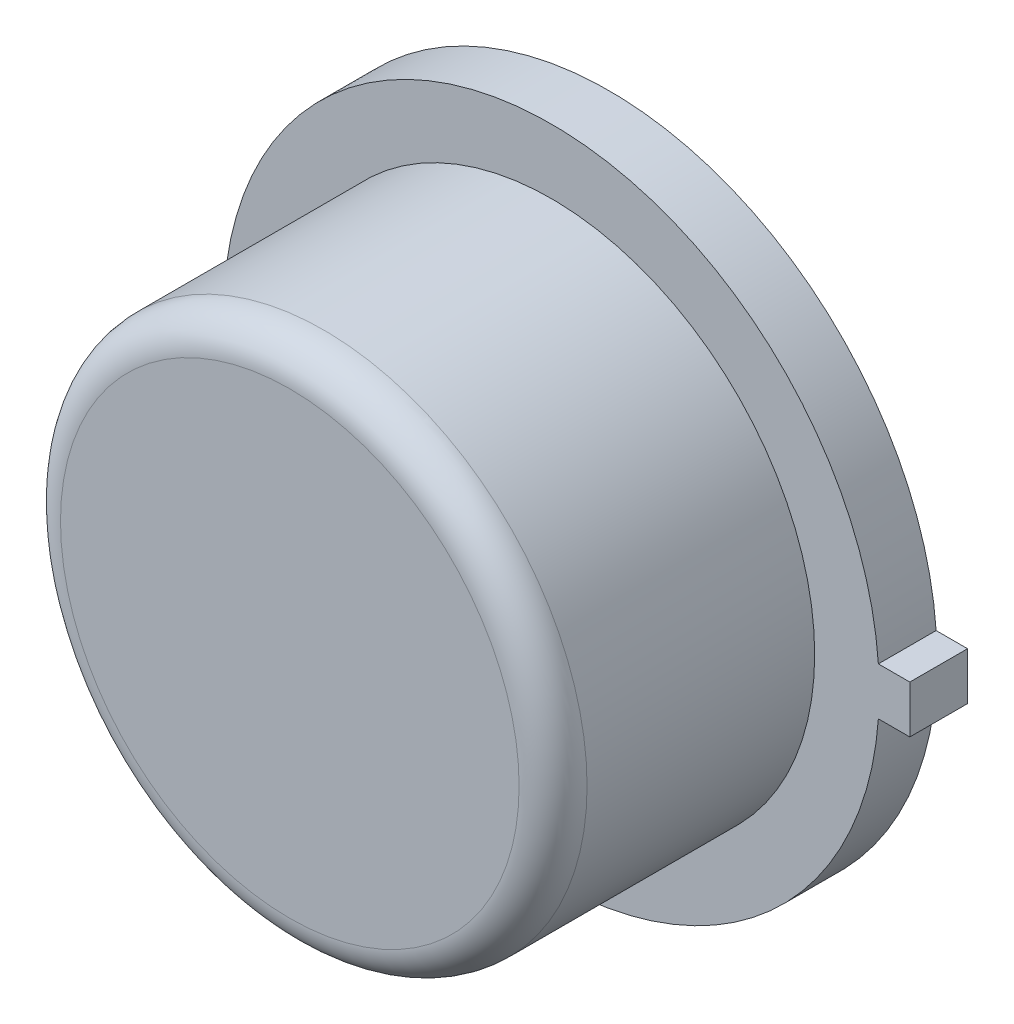
ISO-10303-21;
HEADER;
FILE_DESCRIPTION(('STEP AP214'),'2;1');
FILE_NAME('part.step','',(''),(''),'','','');
FILE_SCHEMA(('AUTOMOTIVE_DESIGN { 1 0 10303 214 1 1 1 1 }'));
ENDSEC;
DATA;
#1=APPLICATION_CONTEXT('core data for automotive mechanical design processes');
#2=APPLICATION_PROTOCOL_DEFINITION('international standard','automotive_design',2000,#1);
#3=PRODUCT_CONTEXT('',#1,'mechanical');
#4=PRODUCT('Part','Part','',(#3));
#5=PRODUCT_RELATED_PRODUCT_CATEGORY('part','',(#4));
#6=PRODUCT_DEFINITION_FORMATION('','',#4);
#7=PRODUCT_DEFINITION_CONTEXT('part definition',#1,'design');
#8=PRODUCT_DEFINITION('design','',#6,#7);
#9=PRODUCT_DEFINITION_SHAPE('','',#8);
#10=(LENGTH_UNIT() NAMED_UNIT(*) SI_UNIT(.MILLI.,.METRE.));
#11=(NAMED_UNIT(*) PLANE_ANGLE_UNIT() SI_UNIT($,.RADIAN.));
#12=(NAMED_UNIT(*) SI_UNIT($,.STERADIAN.) SOLID_ANGLE_UNIT());
#13=UNCERTAINTY_MEASURE_WITH_UNIT(LENGTH_MEASURE(1.E-05),#10,'distance_accuracy_value','');
#14=(GEOMETRIC_REPRESENTATION_CONTEXT(3) GLOBAL_UNCERTAINTY_ASSIGNED_CONTEXT((#13)) GLOBAL_UNIT_ASSIGNED_CONTEXT((#10,
#11,#12)) REPRESENTATION_CONTEXT('',''));
#15=CARTESIAN_POINT('',(0.,0.,0.));
#16=DIRECTION('',(0.,0.,1.));
#17=DIRECTION('',(1.,0.,0.));
#18=AXIS2_PLACEMENT_3D('',#15,#16,#17);
#19=CARTESIAN_POINT('',(-0.00322860507148085,-5.53029106093277,0.));
#20=DIRECTION('',(0.,0.,1.));
#21=DIRECTION('',(1.,0.,0.));
#22=AXIS2_PLACEMENT_3D('',#19,#20,#21);
#23=PLANE('',#22);
#24=DIRECTION('',(1.,0.,0.));
#25=VECTOR('',#24,1.);
#26=CARTESIAN_POINT('',(-0.0032286050714822,0.177799999999999,0.));
#27=LINE('',#26,#25);
#28=CARTESIAN_POINT('',(2.44464278985704,0.177799999999999,0.));
#29=VERTEX_POINT('',#28);
#30=CARTESIAN_POINT('',(2.6797,0.177799999999999,0.));
#31=VERTEX_POINT('',#30);
#32=EDGE_CURVE('E101',#29,#31,#27,.T.);
#33=ORIENTED_EDGE('',*,*,#32,.T.);
#34=DIRECTION('',(0.,-1.,0.));
#35=VECTOR('',#34,1.);
#36=CARTESIAN_POINT('',(2.6797,-5.53029106093277,0.));
#37=LINE('',#36,#35);
#38=CARTESIAN_POINT('',(2.6797,-0.1778,0.));
#39=VERTEX_POINT('',#38);
#40=EDGE_CURVE('E107',#31,#39,#37,.T.);
#41=ORIENTED_EDGE('',*,*,#40,.T.);
#42=DIRECTION('',(-1.,0.,0.));
#43=VECTOR('',#42,1.);
#44=CARTESIAN_POINT('',(-0.00322860507148085,-0.1778,0.));
#45=LINE('',#44,#43);
#46=CARTESIAN_POINT('',(2.44464278985704,-0.1778,0.));
#47=VERTEX_POINT('',#46);
#48=EDGE_CURVE('E105',#39,#47,#45,.T.);
#49=ORIENTED_EDGE('',*,*,#48,.T.);
#50=CARTESIAN_POINT('',(0.,0.,0.));
#51=DIRECTION('',(0.,0.,1.));
#52=DIRECTION('',(1.,0.,0.));
#53=AXIS2_PLACEMENT_3D('',#50,#51,#52);
#54=CIRCLE('',#53,2.4511);
#55=EDGE_CURVE('E91',#29,#47,#54,.T.);
#56=ORIENTED_EDGE('',*,*,#55,.F.);
#57=EDGE_LOOP('',(#33,#41,#49,#56));
#58=FACE_BOUND('',#57,.T.);
#59=CARTESIAN_POINT('',(0.,0.,0.));
#60=DIRECTION('',(0.,0.,1.));
#61=DIRECTION('',(1.,0.,0.));
#62=AXIS2_PLACEMENT_3D('',#59,#60,#61);
#63=CIRCLE('',#62,1.75756648099992);
#64=CARTESIAN_POINT('',(1.75756648099992,0.,0.));
#65=VERTEX_POINT('',#64);
#66=EDGE_CURVE('E113',#65,#65,#63,.F.);
#67=ORIENTED_EDGE('',*,*,#66,.F.);
#68=EDGE_LOOP('',(#67));
#69=FACE_BOUND('',#68,.T.);
#70=ADVANCED_FACE('F32',(#58,#69),#23,.F.);
#71=CARTESIAN_POINT('',(-0.00322860507148085,-5.53029106093277,0.4318));
#72=DIRECTION('',(0.,0.,1.));
#73=DIRECTION('',(1.,0.,0.));
#74=AXIS2_PLACEMENT_3D('',#71,#72,#73);
#75=PLANE('',#74);
#76=DIRECTION('',(1.,0.,0.));
#77=VECTOR('',#76,1.);
#78=CARTESIAN_POINT('',(-0.0032286050714822,0.177799999999999,0.4318));
#79=LINE('',#78,#77);
#80=CARTESIAN_POINT('',(2.44464278985704,0.177799999999999,0.4318));
#81=VERTEX_POINT('',#80);
#82=CARTESIAN_POINT('',(2.6797,0.177799999999999,0.4318));
#83=VERTEX_POINT('',#82);
#84=EDGE_CURVE('E84',#81,#83,#79,.T.);
#85=ORIENTED_EDGE('',*,*,#84,.F.);
#86=CARTESIAN_POINT('',(0.,0.,0.4318));
#87=DIRECTION('',(0.,0.,1.));
#88=DIRECTION('',(1.,0.,0.));
#89=AXIS2_PLACEMENT_3D('',#86,#87,#88);
#90=CIRCLE('',#89,2.4511);
#91=CARTESIAN_POINT('',(2.44464278985704,-0.1778,0.4318));
#92=VERTEX_POINT('',#91);
#93=EDGE_CURVE('E77',#81,#92,#90,.T.);
#94=ORIENTED_EDGE('',*,*,#93,.T.);
#95=DIRECTION('',(-1.,0.,0.));
#96=VECTOR('',#95,1.);
#97=CARTESIAN_POINT('',(-0.00322860507148085,-0.1778,0.4318));
#98=LINE('',#97,#96);
#99=CARTESIAN_POINT('',(2.6797,-0.1778,0.4318));
#100=VERTEX_POINT('',#99);
#101=EDGE_CURVE('E83',#100,#92,#98,.T.);
#102=ORIENTED_EDGE('',*,*,#101,.F.);
#103=DIRECTION('',(0.,-1.,0.));
#104=VECTOR('',#103,1.);
#105=CARTESIAN_POINT('',(2.6797,-5.53029106093277,0.4318));
#106=LINE('',#105,#104);
#107=EDGE_CURVE('E96',#83,#100,#106,.T.);
#108=ORIENTED_EDGE('',*,*,#107,.F.);
#109=EDGE_LOOP('',(#85,#94,#102,#108));
#110=FACE_BOUND('',#109,.T.);
#111=CARTESIAN_POINT('',(0.,0.,0.4318));
#112=DIRECTION('',(0.,0.,1.));
#113=DIRECTION('',(1.,0.,0.));
#114=AXIS2_PLACEMENT_3D('',#111,#112,#113);
#115=CIRCLE('',#114,1.9685);
#116=CARTESIAN_POINT('',(1.9685,0.,0.4318));
#117=VERTEX_POINT('',#116);
#118=EDGE_CURVE('E103',#117,#117,#115,.T.);
#119=ORIENTED_EDGE('',*,*,#118,.F.);
#120=EDGE_LOOP('',(#119));
#121=FACE_BOUND('',#120,.T.);
#122=ADVANCED_FACE('F79',(#110,#121),#75,.T.);
#123=CARTESIAN_POINT('',(-0.0032286050714822,0.177799999999999,0.4318));
#124=DIRECTION('',(0.,1.,0.));
#125=DIRECTION('',(-1.,0.,0.));
#126=AXIS2_PLACEMENT_3D('',#123,#124,#125);
#127=PLANE('',#126);
#128=ORIENTED_EDGE('',*,*,#32,.F.);
#129=DIRECTION('',(0.,0.,-1.));
#130=VECTOR('',#129,1.);
#131=CARTESIAN_POINT('',(2.44464278985704,0.177799999999999,0.4318));
#132=LINE('',#131,#130);
#133=EDGE_CURVE('E71',#81,#29,#132,.T.);
#134=ORIENTED_EDGE('',*,*,#133,.F.);
#135=ORIENTED_EDGE('',*,*,#84,.T.);
#136=DIRECTION('',(0.,0.,-1.));
#137=VECTOR('',#136,1.);
#138=CARTESIAN_POINT('',(2.6797,0.177799999999999,0.4318));
#139=LINE('',#138,#137);
#140=EDGE_CURVE('E49',#83,#31,#139,.T.);
#141=ORIENTED_EDGE('',*,*,#140,.T.);
#142=EDGE_LOOP('',(#128,#134,#135,#141));
#143=FACE_BOUND('',#142,.T.);
#144=ADVANCED_FACE('F136',(#143),#127,.T.);
#145=CARTESIAN_POINT('',(0.,0.,0.4318));
#146=DIRECTION('',(0.,0.,-1.));
#147=DIRECTION('',(-1.,0.,0.));
#148=AXIS2_PLACEMENT_3D('',#145,#146,#147);
#149=CYLINDRICAL_SURFACE('',#148,2.4511);
#150=ORIENTED_EDGE('',*,*,#55,.T.);
#151=DIRECTION('',(0.,0.,-1.));
#152=VECTOR('',#151,1.);
#153=CARTESIAN_POINT('',(2.44464278985704,-0.1778,0.4318));
#154=LINE('',#153,#152);
#155=EDGE_CURVE('E88',#92,#47,#154,.T.);
#156=ORIENTED_EDGE('',*,*,#155,.F.);
#157=ORIENTED_EDGE('',*,*,#93,.F.);
#158=ORIENTED_EDGE('',*,*,#133,.T.);
#159=EDGE_LOOP('',(#150,#156,#157,#158));
#160=FACE_BOUND('',#159,.T.);
#161=ADVANCED_FACE('F89',(#160),#149,.T.);
#162=CARTESIAN_POINT('',(-0.00322860507148085,-0.1778,0.4318));
#163=DIRECTION('',(0.,-1.,0.));
#164=DIRECTION('',(0.,0.,-1.));
#165=AXIS2_PLACEMENT_3D('',#162,#163,#164);
#166=PLANE('',#165);
#167=ORIENTED_EDGE('',*,*,#48,.F.);
#168=DIRECTION('',(0.,0.,-1.));
#169=VECTOR('',#168,1.);
#170=CARTESIAN_POINT('',(2.6797,-0.1778,0.4318));
#171=LINE('',#170,#169);
#172=EDGE_CURVE('E63',#100,#39,#171,.T.);
#173=ORIENTED_EDGE('',*,*,#172,.F.);
#174=ORIENTED_EDGE('',*,*,#101,.T.);
#175=ORIENTED_EDGE('',*,*,#155,.T.);
#176=EDGE_LOOP('',(#167,#173,#174,#175));
#177=FACE_BOUND('',#176,.T.);
#178=ADVANCED_FACE('F95',(#177),#166,.T.);
#179=CARTESIAN_POINT('',(2.6797,-5.53029106093277,0.4318));
#180=DIRECTION('',(1.,0.,0.));
#181=DIRECTION('',(0.,0.,-1.));
#182=AXIS2_PLACEMENT_3D('',#179,#180,#181);
#183=PLANE('',#182);
#184=ORIENTED_EDGE('',*,*,#40,.F.);
#185=ORIENTED_EDGE('',*,*,#140,.F.);
#186=ORIENTED_EDGE('',*,*,#107,.T.);
#187=ORIENTED_EDGE('',*,*,#172,.T.);
#188=EDGE_LOOP('',(#184,#185,#186,#187));
#189=FACE_BOUND('',#188,.T.);
#190=ADVANCED_FACE('F141',(#189),#183,.T.);
#191=CARTESIAN_POINT('',(0.,0.,2.3876));
#192=DIRECTION('',(0.,0.,-1.));
#193=DIRECTION('',(-1.,0.,0.));
#194=AXIS2_PLACEMENT_3D('',#191,#192,#193);
#195=CYLINDRICAL_SURFACE('',#194,1.9685);
#196=CARTESIAN_POINT('',(0.,0.,2.1336));
#197=DIRECTION('',(0.,0.,1.));
#198=DIRECTION('',(1.,0.,0.));
#199=AXIS2_PLACEMENT_3D('',#196,#197,#198);
#200=CIRCLE('',#199,1.9685);
#201=CARTESIAN_POINT('',(1.9685,0.,2.1336));
#202=VERTEX_POINT('',#201);
#203=EDGE_CURVE('E11',#202,#202,#200,.F.);
#204=ORIENTED_EDGE('',*,*,#203,.T.);
#205=EDGE_LOOP('',(#204));
#206=FACE_BOUND('',#205,.T.);
#207=ORIENTED_EDGE('',*,*,#118,.T.);
#208=EDGE_LOOP('',(#207));
#209=FACE_BOUND('',#208,.T.);
#210=ADVANCED_FACE('F144',(#206,#209),#195,.T.);
#211=CARTESIAN_POINT('',(0.,0.,2.3876));
#212=DIRECTION('',(0.,0.,1.));
#213=DIRECTION('',(1.,0.,0.));
#214=AXIS2_PLACEMENT_3D('',#211,#212,#213);
#215=PLANE('',#214);
#216=CARTESIAN_POINT('',(0.,0.,2.3876));
#217=DIRECTION('',(0.,0.,1.));
#218=DIRECTION('',(1.,0.,0.));
#219=AXIS2_PLACEMENT_3D('',#216,#217,#218);
#220=CIRCLE('',#219,1.7145);
#221=CARTESIAN_POINT('',(1.7145,0.,2.3876));
#222=VERTEX_POINT('',#221);
#223=EDGE_CURVE('E41',#222,#222,#220,.T.);
#224=ORIENTED_EDGE('',*,*,#223,.T.);
#225=EDGE_LOOP('',(#224));
#226=FACE_BOUND('',#225,.T.);
#227=ADVANCED_FACE('F118',(#226),#215,.T.);
#228=CARTESIAN_POINT('',(0.,0.,-0.00254));
#229=DIRECTION('',(0.,0.,1.));
#230=DIRECTION('',(1.,0.,0.));
#231=AXIS2_PLACEMENT_3D('',#228,#229,#230);
#232=CYLINDRICAL_SURFACE('',#231,1.75756648099992);
#233=CARTESIAN_POINT('',(0.,0.,-0.00254));
#234=DIRECTION('',(0.,0.,-1.));
#235=DIRECTION('',(-1.,0.,0.));
#236=AXIS2_PLACEMENT_3D('',#233,#234,#235);
#237=CIRCLE('',#236,1.75756648099992);
#238=CARTESIAN_POINT('',(-1.75756648099992,0.,-0.00254));
#239=VERTEX_POINT('',#238);
#240=EDGE_CURVE('E231',#239,#239,#237,.T.);
#241=ORIENTED_EDGE('',*,*,#240,.F.);
#242=EDGE_LOOP('',(#241));
#243=FACE_BOUND('',#242,.T.);
#244=ORIENTED_EDGE('',*,*,#66,.T.);
#245=EDGE_LOOP('',(#244));
#246=FACE_BOUND('',#245,.T.);
#247=ADVANCED_FACE('F126',(#243,#246),#232,.T.);
#248=CARTESIAN_POINT('',(0.,0.,-0.00254));
#249=DIRECTION('',(0.,0.,-1.));
#250=DIRECTION('',(-1.,0.,0.));
#251=AXIS2_PLACEMENT_3D('',#248,#249,#250);
#252=PLANE('',#251);
#253=ORIENTED_EDGE('',*,*,#240,.T.);
#254=EDGE_LOOP('',(#253));
#255=FACE_BOUND('',#254,.T.);
#256=ADVANCED_FACE('F121',(#255),#252,.T.);
#257=CARTESIAN_POINT('',(0.,0.,2.1336));
#258=DIRECTION('',(0.,0.,1.));
#259=DIRECTION('',(1.,0.,0.));
#260=AXIS2_PLACEMENT_3D('',#257,#258,#259);
#261=TOROIDAL_SURFACE('',#260,1.7145,0.254);
#262=ORIENTED_EDGE('',*,*,#203,.F.);
#263=EDGE_LOOP('',(#262));
#264=FACE_BOUND('',#263,.T.);
#265=ORIENTED_EDGE('',*,*,#223,.F.);
#266=EDGE_LOOP('',(#265));
#267=FACE_BOUND('',#266,.T.);
#268=ADVANCED_FACE('F34',(#264,#267),#261,.T.);
#269=CLOSED_SHELL('',(#70,#122,#144,#161,#178,#190,#210,#227,#247,#256,#268));
#270=MANIFOLD_SOLID_BREP('B2',#269);
#271=ADVANCED_BREP_SHAPE_REPRESENTATION('',(#18,#270),#14);
#272=SHAPE_DEFINITION_REPRESENTATION(#9,#271);
ENDSEC;
END-ISO-10303-21;
